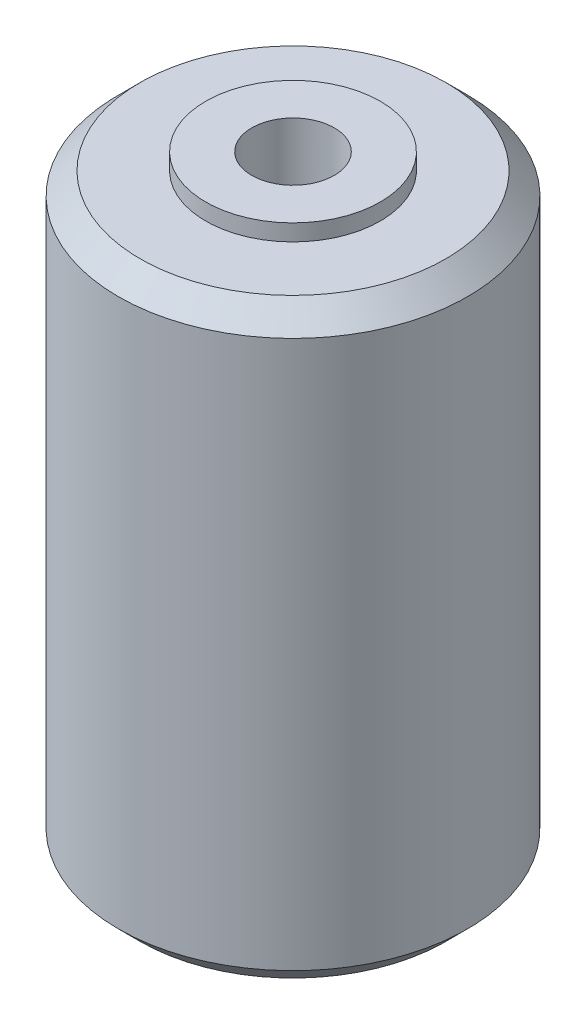
ISO-10303-21;
HEADER;
FILE_DESCRIPTION(('STEP AP214'),'2;1');
FILE_NAME('part.step','',(''),(''),'','','');
FILE_SCHEMA(('AUTOMOTIVE_DESIGN { 1 0 10303 214 1 1 1 1 }'));
ENDSEC;
DATA;
#1=APPLICATION_CONTEXT('core data for automotive mechanical design processes');
#2=APPLICATION_PROTOCOL_DEFINITION('international standard','automotive_design',2000,#1);
#3=PRODUCT_CONTEXT('',#1,'mechanical');
#4=PRODUCT('Part','Part','',(#3));
#5=PRODUCT_RELATED_PRODUCT_CATEGORY('part','',(#4));
#6=PRODUCT_DEFINITION_FORMATION('','',#4);
#7=PRODUCT_DEFINITION_CONTEXT('part definition',#1,'design');
#8=PRODUCT_DEFINITION('design','',#6,#7);
#9=PRODUCT_DEFINITION_SHAPE('','',#8);
#10=(LENGTH_UNIT() NAMED_UNIT(*) SI_UNIT(.MILLI.,.METRE.));
#11=(NAMED_UNIT(*) PLANE_ANGLE_UNIT() SI_UNIT($,.RADIAN.));
#12=(NAMED_UNIT(*) SI_UNIT($,.STERADIAN.) SOLID_ANGLE_UNIT());
#13=UNCERTAINTY_MEASURE_WITH_UNIT(LENGTH_MEASURE(1.E-05),#10,'distance_accuracy_value','');
#14=(GEOMETRIC_REPRESENTATION_CONTEXT(3) GLOBAL_UNCERTAINTY_ASSIGNED_CONTEXT((#13)) GLOBAL_UNIT_ASSIGNED_CONTEXT((#10,
#11,#12)) REPRESENTATION_CONTEXT('',''));
#15=CARTESIAN_POINT('',(0.,0.,0.));
#16=DIRECTION('',(0.,0.,1.));
#17=DIRECTION('',(1.,0.,0.));
#18=AXIS2_PLACEMENT_3D('',#15,#16,#17);
#19=CARTESIAN_POINT('',(0.,41.8605122421,0.));
#20=DIRECTION('',(0.,-1.,0.));
#21=DIRECTION('',(0.,0.,-1.));
#22=AXIS2_PLACEMENT_3D('',#19,#20,#21);
#23=CYLINDRICAL_SURFACE('',#22,6.35);
#24=CARTESIAN_POINT('',(0.,22.6999999997,0.));
#25=DIRECTION('',(0.,-1.,0.));
#26=DIRECTION('',(0.,0.,-1.));
#27=AXIS2_PLACEMENT_3D('',#24,#25,#26);
#28=CIRCLE('',#27,6.35);
#29=CARTESIAN_POINT('',(0.,22.6999999997,-6.35));
#30=VERTEX_POINT('',#29);
#31=EDGE_CURVE('E25',#30,#30,#28,.F.);
#32=ORIENTED_EDGE('',*,*,#31,.F.);
#33=EDGE_LOOP('',(#32));
#34=FACE_BOUND('',#33,.T.);
#35=CARTESIAN_POINT('',(0.,21.5000000004,0.));
#36=DIRECTION('',(0.,-1.,0.));
#37=DIRECTION('',(0.,0.,-1.));
#38=AXIS2_PLACEMENT_3D('',#35,#36,#37);
#39=CIRCLE('',#38,6.35);
#40=CARTESIAN_POINT('',(0.,21.5000000004,-6.35));
#41=VERTEX_POINT('',#40);
#42=EDGE_CURVE('E130',#41,#41,#39,.T.);
#43=ORIENTED_EDGE('',*,*,#42,.F.);
#44=EDGE_LOOP('',(#43));
#45=FACE_BOUND('',#44,.T.);
#46=ADVANCED_FACE('F22',(#34,#45),#23,.T.);
#47=CARTESIAN_POINT('',(0.,22.7,0.));
#48=DIRECTION('',(0.,1.,0.));
#49=DIRECTION('',(0.,0.,1.));
#50=AXIS2_PLACEMENT_3D('',#47,#48,#49);
#51=PLANE('',#50);
#52=CARTESIAN_POINT('',(0.,22.7000000004,0.));
#53=DIRECTION('',(0.,1.,0.));
#54=DIRECTION('',(0.,0.,1.));
#55=AXIS2_PLACEMENT_3D('',#52,#53,#54);
#56=CIRCLE('',#55,3.);
#57=CARTESIAN_POINT('',(0.,22.7000000004,3.));
#58=VERTEX_POINT('',#57);
#59=EDGE_CURVE('E122',#58,#58,#56,.F.);
#60=ORIENTED_EDGE('',*,*,#59,.T.);
#61=EDGE_LOOP('',(#60));
#62=FACE_BOUND('',#61,.T.);
#63=ORIENTED_EDGE('',*,*,#31,.T.);
#64=EDGE_LOOP('',(#63));
#65=FACE_BOUND('',#64,.T.);
#66=ADVANCED_FACE('F111',(#62,#65),#51,.T.);
#67=CARTESIAN_POINT('',(0.,-22.7,0.));
#68=DIRECTION('',(0.,1.,0.));
#69=DIRECTION('',(0.,0.,1.));
#70=AXIS2_PLACEMENT_3D('',#67,#68,#69);
#71=PLANE('',#70);
#72=CARTESIAN_POINT('',(0.,-22.7,0.));
#73=DIRECTION('',(0.,1.,0.));
#74=DIRECTION('',(0.,0.,1.));
#75=AXIS2_PLACEMENT_3D('',#72,#73,#74);
#76=CIRCLE('',#75,3.);
#77=CARTESIAN_POINT('',(0.,-22.7,3.));
#78=VERTEX_POINT('',#77);
#79=EDGE_CURVE('E140',#78,#78,#76,.T.);
#80=ORIENTED_EDGE('',*,*,#79,.T.);
#81=EDGE_LOOP('',(#80));
#82=FACE_BOUND('',#81,.T.);
#83=CARTESIAN_POINT('',(0.,-22.7000000007,0.));
#84=DIRECTION('',(0.,-1.,0.));
#85=DIRECTION('',(0.,0.,-1.));
#86=AXIS2_PLACEMENT_3D('',#83,#84,#85);
#87=CIRCLE('',#86,6.35);
#88=CARTESIAN_POINT('',(0.,-22.7000000007,-6.35));
#89=VERTEX_POINT('',#88);
#90=EDGE_CURVE('E126',#89,#89,#87,.F.);
#91=ORIENTED_EDGE('',*,*,#90,.F.);
#92=EDGE_LOOP('',(#91));
#93=FACE_BOUND('',#92,.T.);
#94=ADVANCED_FACE('F108',(#82,#93),#71,.F.);
#95=CARTESIAN_POINT('',(0.,41.8605122421,0.));
#96=DIRECTION('',(0.,-1.,0.));
#97=DIRECTION('',(0.,0.,-1.));
#98=AXIS2_PLACEMENT_3D('',#95,#96,#97);
#99=CYLINDRICAL_SURFACE('',#98,6.35);
#100=ORIENTED_EDGE('',*,*,#90,.T.);
#101=EDGE_LOOP('',(#100));
#102=FACE_BOUND('',#101,.T.);
#103=CARTESIAN_POINT('',(0.,-21.4999999996,0.));
#104=DIRECTION('',(0.,-1.,0.));
#105=DIRECTION('',(0.,0.,-1.));
#106=AXIS2_PLACEMENT_3D('',#103,#104,#105);
#107=CIRCLE('',#106,6.35);
#108=CARTESIAN_POINT('',(0.,-21.4999999996,-6.35));
#109=VERTEX_POINT('',#108);
#110=EDGE_CURVE('E143',#109,#109,#107,.T.);
#111=ORIENTED_EDGE('',*,*,#110,.T.);
#112=EDGE_LOOP('',(#111));
#113=FACE_BOUND('',#112,.T.);
#114=ADVANCED_FACE('F104',(#102,#113),#99,.T.);
#115=CARTESIAN_POINT('',(0.,21.5,0.));
#116=DIRECTION('',(0.,1.,0.));
#117=DIRECTION('',(0.,0.,1.));
#118=AXIS2_PLACEMENT_3D('',#115,#116,#117);
#119=PLANE('',#118);
#120=ORIENTED_EDGE('',*,*,#42,.T.);
#121=EDGE_LOOP('',(#120));
#122=FACE_BOUND('',#121,.T.);
#123=CARTESIAN_POINT('',(0.,21.5,0.));
#124=DIRECTION('',(0.,-1.,0.));
#125=DIRECTION('',(0.,0.,-1.));
#126=AXIS2_PLACEMENT_3D('',#123,#124,#125);
#127=CIRCLE('',#126,11.1125);
#128=CARTESIAN_POINT('',(0.,21.5,-11.1125));
#129=VERTEX_POINT('',#128);
#130=EDGE_CURVE('E145',#129,#129,#127,.T.);
#131=ORIENTED_EDGE('',*,*,#130,.F.);
#132=EDGE_LOOP('',(#131));
#133=FACE_BOUND('',#132,.T.);
#134=ADVANCED_FACE('F98',(#122,#133),#119,.T.);
#135=CARTESIAN_POINT('',(0.,-22.7,0.));
#136=DIRECTION('',(0.,1.,0.));
#137=DIRECTION('',(0.,0.,1.));
#138=AXIS2_PLACEMENT_3D('',#135,#136,#137);
#139=CYLINDRICAL_SURFACE('',#138,3.);
#140=ORIENTED_EDGE('',*,*,#59,.F.);
#141=EDGE_LOOP('',(#140));
#142=FACE_BOUND('',#141,.T.);
#143=CARTESIAN_POINT('',(1.64999999997881,15.,-2.5054939632621));
#144=CARTESIAN_POINT('',(1.64999840374239,14.9153708936247,-2.50549638400823));
#145=CARTESIAN_POINT('',(1.64345056128063,14.8307298608441,-2.50984429312524));
#146=CARTESIAN_POINT('',(1.61766820329153,14.6641915008115,-2.52653380821172));
#147=CARTESIAN_POINT('',(1.59842157284982,14.5822968721651,-2.53888304741797));
#148=CARTESIAN_POINT('',(1.54839307975191,14.4239437560946,-2.56969382834086));
#149=CARTESIAN_POINT('',(1.51767952421347,14.3474562061832,-2.58811910143637));
#150=CARTESIAN_POINT('',(1.445808157873,14.2007377586914,-2.62894336394163));
#151=CARTESIAN_POINT('',(1.40464700957015,14.1305088701552,-2.65134362247777));
#152=CARTESIAN_POINT('',(1.30819183349229,13.99050944756,-2.7003413001341));
#153=CARTESIAN_POINT('',(1.25189044896297,13.9215011613215,-2.72713413750509));
#154=CARTESIAN_POINT('',(1.12882699873976,13.7932889054095,-2.78033210845858));
#155=CARTESIAN_POINT('',(1.06205795707768,13.7340915285402,-2.80673697055464));
#156=CARTESIAN_POINT('',(0.912963549431928,13.6221708897389,-2.85889021724714));
#157=CARTESIAN_POINT('',(0.829793649592543,13.5704443324042,-2.88438619675496));
#158=CARTESIAN_POINT('',(0.654291228543131,13.4821004677816,-2.92917486122211));
#159=CARTESIAN_POINT('',(0.561971033053669,13.4454631689517,-2.94847574643854));
#160=CARTESIAN_POINT('',(0.391418922382221,13.395186431123,-2.97532920501414));
#161=CARTESIAN_POINT('',(0.314389644419919,13.3783062858042,-2.98451058646595));
#162=CARTESIAN_POINT('',(0.158243160172314,13.3557148045967,-2.99684529996306));
#163=CARTESIAN_POINT('',(0.0791268427110069,13.3499987895632,-3.00000115743207));
#164=CARTESIAN_POINT('',(-0.0857394555554382,13.3500013115927,-2.99999874584159));
#165=CARTESIAN_POINT('',(-0.171491269053558,13.3567153517836,-2.99629076639798));
#166=CARTESIAN_POINT('',(-0.340348376484559,13.3832202031107,-2.98183771920608));
#167=CARTESIAN_POINT('',(-0.423452291679825,13.4030177137218,-2.9710890462504));
#168=CARTESIAN_POINT('',(-0.584397615441963,13.4546521590814,-2.94365850592254));
#169=CARTESIAN_POINT('',(-0.662257568957315,13.4864437222334,-2.92699901221874));
#170=CARTESIAN_POINT('',(-0.811396545708622,13.5608721508766,-2.88921483820871));
#171=CARTESIAN_POINT('',(-0.882674264516605,13.60351115979,-2.8680892755604));
#172=CARTESIAN_POINT('',(-1.02211397679698,13.7017135075675,-2.8215333458695));
#173=CARTESIAN_POINT('',(-1.08972586800158,13.7579633096431,-2.79590698364791));
#174=CARTESIAN_POINT('',(-1.21508250549719,13.8802876821038,-2.74375531569346));
#175=CARTESIAN_POINT('',(-1.27281736357076,13.9463719758152,-2.71722914058829));
#176=CARTESIAN_POINT('',(-1.38253830070294,14.0942501396172,-2.66320939989594));
#177=CARTESIAN_POINT('',(-1.4333919087059,14.1769511793747,-2.6358794181072));
#178=CARTESIAN_POINT('',(-1.52024089502086,14.351297024783,-2.58676868519409));
#179=CARTESIAN_POINT('',(-1.55625793396417,14.4429285487804,-2.56497986218539));
#180=CARTESIAN_POINT('',(-1.60561843894336,14.6120858340947,-2.53429331170645));
#181=CARTESIAN_POINT('',(-1.62218822121407,14.6883498268501,-2.52362317860781));
#182=CARTESIAN_POINT('',(-1.64437513124578,14.8430737320748,-2.50922530446738));
#183=CARTESIAN_POINT('',(-1.65000148001366,14.921531739252,-2.50549171876547));
#184=CARTESIAN_POINT('',(-1.64999840378477,15.0846291059664,-2.50549638400653));
#185=CARTESIAN_POINT('',(-1.64345056132893,15.1692701387406,-2.50984429310046));
#186=CARTESIAN_POINT('',(-1.61766820337297,15.3358084987663,-2.5265338081525));
#187=CARTESIAN_POINT('',(-1.59842157295841,15.4177031274122,-2.53888304734747));
#188=CARTESIAN_POINT('',(-1.54839307990936,15.5760562434857,-2.56969382824747));
#189=CARTESIAN_POINT('',(-1.51767952439265,15.6525437934004,-2.58811910133138));
#190=CARTESIAN_POINT('',(-1.44580815809721,15.7992622409016,-2.62894336381747));
#191=CARTESIAN_POINT('',(-1.40464700981771,15.869491129444,-2.65134362234603));
#192=CARTESIAN_POINT('',(-1.30819183379094,16.0094905520521,-2.70034129998896));
#193=CARTESIAN_POINT('',(-1.25189044928986,16.078498838298,-2.72713413735439));
#194=CARTESIAN_POINT('',(-1.12882699912413,16.20671109423,-2.78033210830183));
#195=CARTESIAN_POINT('',(-1.06205795749126,16.2659084711119,-2.80673697039741));
#196=CARTESIAN_POINT('',(-0.9129635498953,16.377829109954,-2.85889021709868));
#197=CARTESIAN_POINT('',(-0.829793650074897,16.4295556673156,-2.88438619661576));
#198=CARTESIAN_POINT('',(-0.654291229058896,16.517899531996,-2.92917486110651));
#199=CARTESIAN_POINT('',(-0.561971033583834,16.5545368308566,-2.94847574633724));
#200=CARTESIAN_POINT('',(-0.391418922842449,16.6048135687693,-2.97532920495572));
#201=CARTESIAN_POINT('',(-0.314389644792517,16.6216937141282,-2.98451058642913));
#202=CARTESIAN_POINT('',(-0.15824316036224,16.6442851953895,-2.99684529995543));
#203=CARTESIAN_POINT('',(-0.0791268428058968,16.6500012104367,-3.00000115743205));
#204=CARTESIAN_POINT('',(0.0857394555556574,16.6499986884073,-2.99999874584161));
#205=CARTESIAN_POINT('',(0.171491269053796,16.6432846482164,-2.99629076639798));
#206=CARTESIAN_POINT('',(0.340348376484729,16.6167797968893,-2.98183771920605));
#207=CARTESIAN_POINT('',(0.423452291679915,16.5969822862782,-2.97108904625038));
#208=CARTESIAN_POINT('',(0.584397615442001,16.5453478409186,-2.94365850592253));
#209=CARTESIAN_POINT('',(0.662257568957375,16.5135562777665,-2.92699901221873));
#210=CARTESIAN_POINT('',(0.811396545708668,16.4391278491234,-2.88921483820869));
#211=CARTESIAN_POINT('',(0.88267426451662,16.39648884021,-2.86808927556038));
#212=CARTESIAN_POINT('',(1.0221139767969,16.2982864924326,-2.82153334586954));
#213=CARTESIAN_POINT('',(1.08972586800144,16.242036690357,-2.795906983648));
#214=CARTESIAN_POINT('',(1.21508250549701,16.1197123178963,-2.74375531569351));
#215=CARTESIAN_POINT('',(1.27281736357056,16.0536280241849,-2.71722914058825));
#216=CARTESIAN_POINT('',(1.38253830070317,15.9057498603827,-2.66320939989597));
#217=CARTESIAN_POINT('',(1.43339190870662,15.823048820625,-2.63587941810743));
#218=CARTESIAN_POINT('',(1.52024089502039,15.6487029752167,-2.58676868519372));
#219=CARTESIAN_POINT('',(1.55625793396207,15.5570714512195,-2.56497986218423));
#220=CARTESIAN_POINT('',(1.60561843896328,15.3879141658426,-2.53429331169599));
#221=CARTESIAN_POINT('',(1.62218822124758,15.3116501730212,-2.52362317859283));
#222=CARTESIAN_POINT('',(1.64437513126856,15.1569262676613,-2.50922530444582));
#223=CARTESIAN_POINT('',(1.6500014800121,15.078468260415,-2.50549171874191));
#224=CARTESIAN_POINT('',(1.64999999997881,15.,-2.5054939632621));
#225=B_SPLINE_CURVE_WITH_KNOTS('',3,(#143,#144,#145,#146,#147,#148,#149,#150,#151,#152,#153,
#154,#155,#156,#157,#158,#159,#160,#161,#162,#163,#164,#165,#166,#167,#168,#169,#170,#171,#172,
#173,#174,#175,#176,#177,#178,#179,#180,#181,#182,#183,#184,#185,#186,#187,#188,#189,#190,#191,
#192,#193,#194,#195,#196,#197,#198,#199,#200,#201,#202,#203,#204,#205,#206,#207,#208,#209,#210,
#211,#212,#213,#214,#215,#216,#217,#218,#219,#220,#221,#222,#223,#224),.UNSPECIFIED.,.T.,.F.,(4,
2,2,2,2,2,2,2,2,2,2,2,2,2,2,2,2,2,2,2,2,2,2,2,2,2,2,2,2,2,2,2,2,2,2,2,2,2,2,2,4),(0.,
0.253564174119438,0.507370604325378,0.759688655533113,1.01208741182867,1.2899706705788,
1.5680399127192,1.87005826832862,2.17167518687084,2.40886924606111,2.64596387039523,
2.90287244034506,3.15991266401299,3.41599013933307,3.67211825414013,3.94583529023402,
4.21982476976412,4.52089904055169,4.82153218701447,5.05683570170709,5.29194086211861,
5.54550503621304,5.7993114663959,6.05162951758052,6.30402827385173,6.58191153256248,
6.85998077466422,7.16199913027546,7.46361604882062,7.7008101082955,7.93790473291365,
8.19481330286378,8.4518535265314,8.70793100185158,8.96405911665854,9.23777615275208,
9.51176563228254,9.81283990307056,10.1134730495329,10.3487765644238,10.5838817250346),.UNSPECIFIED.);
#226=CARTESIAN_POINT('',(1.64999999997881,15.,-2.5054939632621));
#227=VERTEX_POINT('',#226);
#228=EDGE_CURVE('E83',#227,#227,#225,.T.);
#229=ORIENTED_EDGE('',*,*,#228,.T.);
#230=EDGE_LOOP('',(#229));
#231=FACE_BOUND('',#230,.T.);
#232=CARTESIAN_POINT('',(1.64999999997882,-15.,-2.50549396326209));
#233=CARTESIAN_POINT('',(1.6499984037424,-15.0846291063753,-2.50549638400822));
#234=CARTESIAN_POINT('',(1.64345056128064,-15.1692701391559,-2.50984429312524));
#235=CARTESIAN_POINT('',(1.61766820329154,-15.3358084991885,-2.52653380821171));
#236=CARTESIAN_POINT('',(1.59842157284983,-15.4177031278349,-2.53888304741796));
#237=CARTESIAN_POINT('',(1.54839307975192,-15.5760562439054,-2.56969382834085));
#238=CARTESIAN_POINT('',(1.51767952421348,-15.6525437938168,-2.58811910143636));
#239=CARTESIAN_POINT('',(1.44580815787301,-15.7992622413086,-2.62894336394162));
#240=CARTESIAN_POINT('',(1.40464700957016,-15.8694911298448,-2.65134362247776));
#241=CARTESIAN_POINT('',(1.3081918334923,-16.00949055244,-2.7003413001341));
#242=CARTESIAN_POINT('',(1.25189044896299,-16.0784988386785,-2.72713413750509));
#243=CARTESIAN_POINT('',(1.12882699873977,-16.2067110945905,-2.78033210845857));
#244=CARTESIAN_POINT('',(1.0620579570777,-16.2659084714598,-2.80673697055464));
#245=CARTESIAN_POINT('',(0.912963549431941,-16.3778291102611,-2.85889021724714));
#246=CARTESIAN_POINT('',(0.829793649592557,-16.4295556675958,-2.88438619675496));
#247=CARTESIAN_POINT('',(0.654291228543146,-16.5178995322184,-2.92917486122211));
#248=CARTESIAN_POINT('',(0.561971033053684,-16.5545368310483,-2.94847574643854));
#249=CARTESIAN_POINT('',(0.391418922382234,-16.604813568877,-2.97532920501414));
#250=CARTESIAN_POINT('',(0.314389644419929,-16.6216937141958,-2.98451058646595));
#251=CARTESIAN_POINT('',(0.158243160172319,-16.6442851954033,-2.99684529996305));
#252=CARTESIAN_POINT('',(0.079126842711009,-16.6500012104368,-3.00000115743207));
#253=CARTESIAN_POINT('',(-0.0857394555554387,-16.6499986884073,-2.99999874584159));
#254=CARTESIAN_POINT('',(-0.171491269053559,-16.6432846482164,-2.99629076639798));
#255=CARTESIAN_POINT('',(-0.340348376484559,-16.6167797968893,-2.98183771920608));
#256=CARTESIAN_POINT('',(-0.423452291679826,-16.5969822862782,-2.9710890462504));
#257=CARTESIAN_POINT('',(-0.584397615441963,-16.5453478409186,-2.94365850592254));
#258=CARTESIAN_POINT('',(-0.662257568957316,-16.5135562777666,-2.92699901221874));
#259=CARTESIAN_POINT('',(-0.811396545708622,-16.4391278491234,-2.88921483820871));
#260=CARTESIAN_POINT('',(-0.882674264516604,-16.39648884021,-2.8680892755604));
#261=CARTESIAN_POINT('',(-1.02211397679698,-16.2982864924325,-2.8215333458695));
#262=CARTESIAN_POINT('',(-1.08972586800158,-16.2420366903569,-2.79590698364792));
#263=CARTESIAN_POINT('',(-1.21508250549719,-16.1197123178962,-2.74375531569346));
#264=CARTESIAN_POINT('',(-1.27281736357076,-16.0536280241848,-2.71722914058829));
#265=CARTESIAN_POINT('',(-1.38253830070294,-15.9057498603828,-2.66320939989594));
#266=CARTESIAN_POINT('',(-1.43339190870589,-15.8230488206253,-2.63587941810721));
#267=CARTESIAN_POINT('',(-1.52024089502085,-15.648702975217,-2.58676868519409));
#268=CARTESIAN_POINT('',(-1.55625793396416,-15.5570714512196,-2.56497986218539));
#269=CARTESIAN_POINT('',(-1.60561843894335,-15.3879141659053,-2.53429331170645));
#270=CARTESIAN_POINT('',(-1.62218822121406,-15.3116501731499,-2.52362317860782));
#271=CARTESIAN_POINT('',(-1.64437513124577,-15.1569262679252,-2.50922530446738));
#272=CARTESIAN_POINT('',(-1.65000148001365,-15.078468260748,-2.50549171876548));
#273=CARTESIAN_POINT('',(-1.64999840378476,-14.9153708940336,-2.50549638400653));
#274=CARTESIAN_POINT('',(-1.64345056132892,-14.8307298612594,-2.50984429310046));
#275=CARTESIAN_POINT('',(-1.61766820337296,-14.6641915012337,-2.5265338081525));
#276=CARTESIAN_POINT('',(-1.5984215729584,-14.5822968725878,-2.53888304734747));
#277=CARTESIAN_POINT('',(-1.54839307990935,-14.4239437565143,-2.56969382824748));
#278=CARTESIAN_POINT('',(-1.51767952439264,-14.3474562065996,-2.58811910133138));
#279=CARTESIAN_POINT('',(-1.4458081580972,-14.2007377590984,-2.62894336381748));
#280=CARTESIAN_POINT('',(-1.40464700981771,-14.130508870556,-2.65134362234604));
#281=CARTESIAN_POINT('',(-1.30819183379094,-13.9905094479479,-2.70034129998896));
#282=CARTESIAN_POINT('',(-1.25189044928986,-13.921501161702,-2.72713413735439));
#283=CARTESIAN_POINT('',(-1.12882699912413,-13.79328890577,-2.78033210830183));
#284=CARTESIAN_POINT('',(-1.06205795749126,-13.7340915288881,-2.80673697039741));
#285=CARTESIAN_POINT('',(-0.912963549895295,-13.622170890046,-2.85889021709868));
#286=CARTESIAN_POINT('',(-0.829793650074891,-13.5704443326844,-2.88438619661576));
#287=CARTESIAN_POINT('',(-0.654291229058888,-13.482100468004,-2.92917486110652));
#288=CARTESIAN_POINT('',(-0.561971033583826,-13.4454631691434,-2.94847574633725));
#289=CARTESIAN_POINT('',(-0.391418922842443,-13.3951864312307,-2.97532920495573));
#290=CARTESIAN_POINT('',(-0.314389644792512,-13.3783062858718,-2.98451058642914));
#291=CARTESIAN_POINT('',(-0.158243160362237,-13.3557148046105,-2.99684529995543));
#292=CARTESIAN_POINT('',(-0.0791268428058954,-13.3499987895633,-3.00000115743205));
#293=CARTESIAN_POINT('',(0.0857394555556574,-13.3500013115927,-2.99999874584161));
#294=CARTESIAN_POINT('',(0.171491269053796,-13.3567153517836,-2.99629076639798));
#295=CARTESIAN_POINT('',(0.340348376484729,-13.3832202031107,-2.98183771920605));
#296=CARTESIAN_POINT('',(0.423452291679915,-13.4030177137218,-2.97108904625038));
#297=CARTESIAN_POINT('',(0.584397615442001,-13.4546521590814,-2.94365850592253));
#298=CARTESIAN_POINT('',(0.662257568957375,-13.4864437222335,-2.92699901221873));
#299=CARTESIAN_POINT('',(0.811396545708669,-13.5608721508766,-2.88921483820869));
#300=CARTESIAN_POINT('',(0.882674264516621,-13.60351115979,-2.86808927556038));
#301=CARTESIAN_POINT('',(1.0221139767969,-13.7017135075674,-2.82153334586954));
#302=CARTESIAN_POINT('',(1.08972586800144,-13.757963309643,-2.795906983648));
#303=CARTESIAN_POINT('',(1.21508250549701,-13.8802876821037,-2.74375531569351));
#304=CARTESIAN_POINT('',(1.27281736357056,-13.9463719758151,-2.71722914058825));
#305=CARTESIAN_POINT('',(1.38253830070317,-14.0942501396173,-2.66320939989597));
#306=CARTESIAN_POINT('',(1.43339190870662,-14.1769511793749,-2.63587941810743));
#307=CARTESIAN_POINT('',(1.5202408950204,-14.3512970247833,-2.58676868519372));
#308=CARTESIAN_POINT('',(1.55625793396208,-14.4429285487805,-2.56497986218422));
#309=CARTESIAN_POINT('',(1.60561843896329,-14.6120858341574,-2.53429331169599));
#310=CARTESIAN_POINT('',(1.62218822124759,-14.6883498269788,-2.52362317859283));
#311=CARTESIAN_POINT('',(1.64437513126857,-14.8430737323387,-2.50922530444582));
#312=CARTESIAN_POINT('',(1.65000148001211,-14.921531739585,-2.5054917187419));
#313=CARTESIAN_POINT('',(1.64999999997882,-15.,-2.50549396326209));
#314=B_SPLINE_CURVE_WITH_KNOTS('',3,(#232,#233,#234,#235,#236,#237,#238,#239,#240,#241,#242,
#243,#244,#245,#246,#247,#248,#249,#250,#251,#252,#253,#254,#255,#256,#257,#258,#259,#260,#261,
#262,#263,#264,#265,#266,#267,#268,#269,#270,#271,#272,#273,#274,#275,#276,#277,#278,#279,#280,
#281,#282,#283,#284,#285,#286,#287,#288,#289,#290,#291,#292,#293,#294,#295,#296,#297,#298,#299,
#300,#301,#302,#303,#304,#305,#306,#307,#308,#309,#310,#311,#312,#313),.UNSPECIFIED.,.T.,.F.,(4,
2,2,2,2,2,2,2,2,2,2,2,2,2,2,2,2,2,2,2,2,2,2,2,2,2,2,2,2,2,2,2,2,2,2,2,2,2,2,2,4),(0.,
0.253564174119438,0.507370604325378,0.759688655533112,1.01208741182867,1.28997067057879,
1.5680399127192,1.87005826832862,2.17167518687083,2.40886924606111,2.64596387039525,
2.90287244034507,3.159912664013,3.41599013933309,3.67211825414014,3.94583529023403,
4.21982476976414,4.52089904055171,4.82153218701449,5.0568357017071,5.29194086211861,
5.54550503621304,5.7993114663959,6.05162951758052,6.30402827385172,6.58191153256248,
6.85998077466422,7.16199913027546,7.46361604882062,7.7008101082955,7.93790473291364,
8.19481330286377,8.45185352653139,8.70793100185156,8.96405911665853,9.23777615275207,
9.51176563228253,9.81283990307055,10.1134730495329,10.3487765644238,10.5838817250346),.UNSPECIFIED.);
#315=CARTESIAN_POINT('',(1.64999999997882,-15.,-2.50549396326209));
#316=VERTEX_POINT('',#315);
#317=EDGE_CURVE('E78',#316,#316,#314,.T.);
#318=ORIENTED_EDGE('',*,*,#317,.T.);
#319=EDGE_LOOP('',(#318));
#320=FACE_BOUND('',#319,.T.);
#321=ORIENTED_EDGE('',*,*,#79,.F.);
#322=EDGE_LOOP('',(#321));
#323=FACE_BOUND('',#322,.T.);
#324=ADVANCED_FACE('F92',(#142,#231,#320,#323),#139,.F.);
#325=CARTESIAN_POINT('',(0.,-21.5,0.));
#326=DIRECTION('',(0.,1.,0.));
#327=DIRECTION('',(0.,0.,1.));
#328=AXIS2_PLACEMENT_3D('',#325,#326,#327);
#329=PLANE('',#328);
#330=ORIENTED_EDGE('',*,*,#110,.F.);
#331=EDGE_LOOP('',(#330));
#332=FACE_BOUND('',#331,.T.);
#333=CARTESIAN_POINT('',(0.,-21.5000000000007,0.));
#334=DIRECTION('',(0.,1.,0.));
#335=DIRECTION('',(0.,0.,1.));
#336=AXIS2_PLACEMENT_3D('',#333,#334,#335);
#337=CIRCLE('',#336,11.1125000000007);
#338=CARTESIAN_POINT('',(0.,-21.5000000000007,11.1125000000007));
#339=VERTEX_POINT('',#338);
#340=EDGE_CURVE('E46',#339,#339,#337,.T.);
#341=ORIENTED_EDGE('',*,*,#340,.F.);
#342=EDGE_LOOP('',(#341));
#343=FACE_BOUND('',#342,.T.);
#344=ADVANCED_FACE('F97',(#332,#343),#329,.F.);
#345=CARTESIAN_POINT('',(0.,19.9124999999993,0.));
#346=DIRECTION('',(0.,-1.,0.));
#347=DIRECTION('',(0.,0.,-1.));
#348=AXIS2_PLACEMENT_3D('',#345,#346,#347);
#349=CONICAL_SURFACE('',#348,12.6999999999993,0.785398163397);
#350=ORIENTED_EDGE('',*,*,#130,.T.);
#351=EDGE_LOOP('',(#350));
#352=FACE_BOUND('',#351,.T.);
#353=CARTESIAN_POINT('',(0.,19.9125,0.));
#354=DIRECTION('',(0.,-1.,0.));
#355=DIRECTION('',(0.,0.,-1.));
#356=AXIS2_PLACEMENT_3D('',#353,#354,#355);
#357=CIRCLE('',#356,12.7);
#358=CARTESIAN_POINT('',(0.,19.9125,-12.7));
#359=VERTEX_POINT('',#358);
#360=EDGE_CURVE('E43',#359,#359,#357,.T.);
#361=ORIENTED_EDGE('',*,*,#360,.F.);
#362=EDGE_LOOP('',(#361));
#363=FACE_BOUND('',#362,.T.);
#364=ADVANCED_FACE('F159',(#352,#363),#349,.T.);
#365=CARTESIAN_POINT('',(0.,15.,0.));
#366=DIRECTION('',(0.,0.,1.));
#367=DIRECTION('',(1.,0.,0.));
#368=AXIS2_PLACEMENT_3D('',#365,#366,#367);
#369=CYLINDRICAL_SURFACE('',#368,1.65);
#370=ORIENTED_EDGE('',*,*,#228,.F.);
#371=EDGE_LOOP('',(#370));
#372=FACE_BOUND('',#371,.T.);
#373=CARTESIAN_POINT('',(0.,16.65,-12.7));
#374=CARTESIAN_POINT('',(-0.0922613706015616,16.6499960266368,-12.6999986483359));
#375=CARTESIAN_POINT('',(-0.184581712969282,16.6422353589815,-12.698983991526));
#376=CARTESIAN_POINT('',(-0.36665381896258,16.6113994418027,-12.6950337968835));
#377=CARTESIAN_POINT('',(-0.45640272894946,16.5883078169848,-12.6920962051737));
#378=CARTESIAN_POINT('',(-0.630667643384161,16.5275031550844,-12.6846308888954));
#379=CARTESIAN_POINT('',(-0.715187195161179,16.4898001585595,-12.6801042564754));
#380=CARTESIAN_POINT('',(-0.876680404764729,16.4008671595393,-12.6699639395096));
#381=CARTESIAN_POINT('',(-0.953655618333544,16.3496399539966,-12.6643504797955));
#382=CARTESIAN_POINT('',(-1.09834448754996,16.2347934063494,-12.6526259549517));
#383=CARTESIAN_POINT('',(-1.16600785478158,16.1711109550385,-12.6465124520145));
#384=CARTESIAN_POINT('',(-1.28973411953138,16.0332781566404,-12.6344948729124));
#385=CARTESIAN_POINT('',(-1.34579386345574,15.9591249730398,-12.6285908540406));
#386=CARTESIAN_POINT('',(-1.44491493186581,15.8021088518647,-12.61763548826));
#387=CARTESIAN_POINT('',(-1.48792229372565,15.7192116153581,-12.6125877182579));
#388=CARTESIAN_POINT('',(-1.55934132232046,15.5473524320158,-12.6039581295904));
#389=CARTESIAN_POINT('',(-1.58776927485075,15.4583973784371,-12.6003746761374));
#390=CARTESIAN_POINT('',(-1.62228028697603,15.307466304609,-12.5959671608161));
#391=CARTESIAN_POINT('',(-1.6326603754509,15.2464533709182,-12.5946206585225));
#392=CARTESIAN_POINT('',(-1.64652153728125,15.1236357848426,-12.5928160112748));
#393=CARTESIAN_POINT('',(-1.65000266511255,15.0618311387133,-12.5923578593062));
#394=CARTESIAN_POINT('',(-1.64999602341034,14.9077423322541,-12.5923601889618));
#395=CARTESIAN_POINT('',(-1.64223595773393,14.8154256831494,-12.5933836646408));
#396=CARTESIAN_POINT('',(-1.61140264942754,14.6333612522402,-12.597365349171));
#397=CARTESIAN_POINT('',(-1.58831301888257,14.543616326933,-12.6003256284931));
#398=CARTESIAN_POINT('',(-1.52751418964121,14.3693598394773,-12.6078401281504));
#399=CARTESIAN_POINT('',(-1.48981512575569,14.2848446963717,-12.612393243296));
#400=CARTESIAN_POINT('',(-1.4008913903022,14.1233588852263,-12.6225788360358));
#401=CARTESIAN_POINT('',(-1.34966950620144,14.0463866668373,-12.6282110911207));
#402=CARTESIAN_POINT('',(-1.23482835305465,13.9016944622995,-12.6399580315527));
#403=CARTESIAN_POINT('',(-1.17114478450977,13.8340257024641,-12.6460751167178));
#404=CARTESIAN_POINT('',(-1.03330748177513,13.7102890152266,-12.6580824507853));
#405=CARTESIAN_POINT('',(-0.959150925293786,13.6542242249704,-12.6639726379962));
#406=CARTESIAN_POINT('',(-0.802131812823004,13.5550978506845,-12.6748884883045));
#407=CARTESIAN_POINT('',(-0.719235538826974,13.512089310033,-12.6799105900136));
#408=CARTESIAN_POINT('',(-0.547378437680788,13.4406678269497,-12.6884888294279));
#409=CARTESIAN_POINT('',(-0.458424495836816,13.4122386168661,-12.6920466001579));
#410=CARTESIAN_POINT('',(-0.307490063388877,13.3777240200307,-12.6964208871056));
#411=CARTESIAN_POINT('',(-0.246472366923986,13.3673423086062,-12.6977566275013));
#412=CARTESIAN_POINT('',(-0.123645272995091,13.353478993515,-12.6995466335294));
#413=CARTESIAN_POINT('',(-0.0618358816038709,13.3499973369525,-12.7000009059191));
#414=CARTESIAN_POINT('',(0.0922613706015605,13.3500039733632,-12.6999986483359));
#415=CARTESIAN_POINT('',(0.184581712969281,13.3577646410185,-12.698983991526));
#416=CARTESIAN_POINT('',(0.366653818962579,13.3886005581973,-12.6950337968835));
#417=CARTESIAN_POINT('',(0.456402728949459,13.4116921830152,-12.6920962051737));
#418=CARTESIAN_POINT('',(0.63066764338416,13.4724968449156,-12.6846308888954));
#419=CARTESIAN_POINT('',(0.715187195161178,13.5101998414405,-12.6801042564754));
#420=CARTESIAN_POINT('',(0.876680404764728,13.5991328404607,-12.6699639395096));
#421=CARTESIAN_POINT('',(0.953655618333541,13.6503600460034,-12.6643504797955));
#422=CARTESIAN_POINT('',(1.09834448754995,13.7652065936506,-12.6526259549517));
#423=CARTESIAN_POINT('',(1.16600785478157,13.8288890449615,-12.6465124520145));
#424=CARTESIAN_POINT('',(1.28973411953137,13.9667218433596,-12.6344948729124));
#425=CARTESIAN_POINT('',(1.34579386345573,14.0408750269602,-12.6285908540406));
#426=CARTESIAN_POINT('',(1.44491493186581,14.1978911481353,-12.61763548826));
#427=CARTESIAN_POINT('',(1.48792229372564,14.280788384642,-12.6125877182579));
#428=CARTESIAN_POINT('',(1.55934132232045,14.4526475679842,-12.6039581295904));
#429=CARTESIAN_POINT('',(1.58776927485075,14.5416026215629,-12.6003746761374));
#430=CARTESIAN_POINT('',(1.62228028697602,14.692533695391,-12.5959671608161));
#431=CARTESIAN_POINT('',(1.63266037545089,14.7535466290818,-12.5946206585225));
#432=CARTESIAN_POINT('',(1.64652153728123,14.8763642151574,-12.5928160112748));
#433=CARTESIAN_POINT('',(1.65000266511254,14.9381688612867,-12.5923578593062));
#434=CARTESIAN_POINT('',(1.64999602341032,15.0922576677459,-12.5923601889618));
#435=CARTESIAN_POINT('',(1.64223595773392,15.1845743168506,-12.5933836646408));
#436=CARTESIAN_POINT('',(1.61140264942753,15.3666387477598,-12.597365349171));
#437=CARTESIAN_POINT('',(1.58831301888255,15.456383673067,-12.6003256284931));
#438=CARTESIAN_POINT('',(1.5275141896412,15.6306401605227,-12.6078401281504));
#439=CARTESIAN_POINT('',(1.48981512575567,15.7151553036283,-12.612393243296));
#440=CARTESIAN_POINT('',(1.40089139030219,15.8766411147737,-12.6225788360358));
#441=CARTESIAN_POINT('',(1.34966950620143,15.9536133331627,-12.6282110911207));
#442=CARTESIAN_POINT('',(1.23482835305464,16.0983055377005,-12.6399580315527));
#443=CARTESIAN_POINT('',(1.17114478450975,16.1659742975359,-12.6460751167178));
#444=CARTESIAN_POINT('',(1.03330748177512,16.2897109847734,-12.6580824507853));
#445=CARTESIAN_POINT('',(0.959150925293773,16.3457757750296,-12.6639726379962));
#446=CARTESIAN_POINT('',(0.802131812822991,16.4449021493155,-12.6748884883045));
#447=CARTESIAN_POINT('',(0.719235538826961,16.487910689967,-12.6799105900136));
#448=CARTESIAN_POINT('',(0.547378437680775,16.5593321730503,-12.6884888294279));
#449=CARTESIAN_POINT('',(0.458424495836804,16.5877613831339,-12.6920466001579));
#450=CARTESIAN_POINT('',(0.307490063388866,16.6222759799693,-12.6964208871056));
#451=CARTESIAN_POINT('',(0.246472366923977,16.6326576913938,-12.6977566275013));
#452=CARTESIAN_POINT('',(0.123645272995085,16.646521006485,-12.6995466335294));
#453=CARTESIAN_POINT('',(0.0618358816038677,16.6500026630475,-12.7000009059191));
#454=CARTESIAN_POINT('',(0.,16.65,-12.7));
#455=B_SPLINE_CURVE_WITH_KNOTS('',3,(#373,#374,#375,#376,#377,#378,#379,#380,#381,#382,#383,
#384,#385,#386,#387,#388,#389,#390,#391,#392,#393,#394,#395,#396,#397,#398,#399,#400,#401,#402,
#403,#404,#405,#406,#407,#408,#409,#410,#411,#412,#413,#414,#415,#416,#417,#418,#419,#420,#421,
#422,#423,#424,#425,#426,#427,#428,#429,#430,#431,#432,#433,#434,#435,#436,#437,#438,#439,#440,
#441,#442,#443,#444,#445,#446,#447,#448,#449,#450,#451,#452,#453,#454),.UNSPECIFIED.,.T.,.F.,(4,
2,2,2,2,2,2,2,2,2,2,2,2,2,2,2,2,2,2,2,2,2,2,2,2,2,2,2,2,2,2,2,2,2,2,2,2,2,2,2,4),(0.,
0.276557981767843,0.553411836773097,0.830075781331942,1.1066825535578,1.38472897037035,
1.66285085477184,1.9421073913385,2.22105130377737,2.4063946191166,2.59173647093545,
2.86828332645777,3.14512629864269,3.42177756298099,3.69837184548996,3.97643282857887,
4.25456888785073,4.53382025192016,4.81275934497319,4.99811685272514,5.1834729395218,
5.46003092128964,5.7368847762949,6.01354872085374,6.2901554930796,6.56820190989215,
6.84632379429364,7.1255803308603,7.40452424329917,7.5898675586384,7.77520941045723,
8.05175626597956,8.32859923816448,8.60525050250278,8.88184478501175,9.15990576810066,
9.43804182737252,9.71729319144195,9.99623228449498,10.1815897922469,10.3669458790436),.UNSPECIFIED.);
#456=CARTESIAN_POINT('',(0.,16.65,-12.7));
#457=VERTEX_POINT('',#456);
#458=EDGE_CURVE('E40',#457,#457,#455,.T.);
#459=ORIENTED_EDGE('',*,*,#458,.F.);
#460=EDGE_LOOP('',(#459));
#461=FACE_BOUND('',#460,.T.);
#462=ADVANCED_FACE('F71',(#372,#461),#369,.F.);
#463=CARTESIAN_POINT('',(0.,-15.,0.));
#464=DIRECTION('',(0.,0.,1.));
#465=DIRECTION('',(1.,0.,0.));
#466=AXIS2_PLACEMENT_3D('',#463,#464,#465);
#467=CYLINDRICAL_SURFACE('',#466,1.65);
#468=ORIENTED_EDGE('',*,*,#317,.F.);
#469=EDGE_LOOP('',(#468));
#470=FACE_BOUND('',#469,.T.);
#471=CARTESIAN_POINT('',(0.,-13.35,-12.7));
#472=CARTESIAN_POINT('',(-0.0922613706015615,-13.3500039733632,-12.6999986483359));
#473=CARTESIAN_POINT('',(-0.184581712969282,-13.3577646410185,-12.698983991526));
#474=CARTESIAN_POINT('',(-0.366653818962579,-13.3886005581973,-12.6950337968835));
#475=CARTESIAN_POINT('',(-0.45640272894946,-13.4116921830152,-12.6920962051737));
#476=CARTESIAN_POINT('',(-0.630667643384161,-13.4724968449156,-12.6846308888954));
#477=CARTESIAN_POINT('',(-0.715187195161178,-13.5101998414405,-12.6801042564754));
#478=CARTESIAN_POINT('',(-0.876680404764728,-13.5991328404607,-12.6699639395096));
#479=CARTESIAN_POINT('',(-0.953655618333542,-13.6503600460034,-12.6643504797955));
#480=CARTESIAN_POINT('',(-1.09834448754995,-13.7652065936506,-12.6526259549517));
#481=CARTESIAN_POINT('',(-1.16600785478157,-13.8288890449615,-12.6465124520145));
#482=CARTESIAN_POINT('',(-1.28973411953137,-13.9667218433596,-12.6344948729124));
#483=CARTESIAN_POINT('',(-1.34579386345574,-14.0408750269602,-12.6285908540406));
#484=CARTESIAN_POINT('',(-1.44491493186581,-14.1978911481353,-12.61763548826));
#485=CARTESIAN_POINT('',(-1.48792229372564,-14.280788384642,-12.6125877182579));
#486=CARTESIAN_POINT('',(-1.55934132232045,-14.4526475679842,-12.6039581295904));
#487=CARTESIAN_POINT('',(-1.58776927485075,-14.5416026215629,-12.6003746761374));
#488=CARTESIAN_POINT('',(-1.62228028697603,-14.692533695391,-12.5959671608161));
#489=CARTESIAN_POINT('',(-1.63266037545089,-14.7535466290818,-12.5946206585225));
#490=CARTESIAN_POINT('',(-1.64652153728124,-14.8763642151574,-12.5928160112748));
#491=CARTESIAN_POINT('',(-1.65000266511254,-14.9381688612867,-12.5923578593062));
#492=CARTESIAN_POINT('',(-1.64999602341033,-15.092257667746,-12.5923601889618));
#493=CARTESIAN_POINT('',(-1.64223595773392,-15.1845743168506,-12.5933836646408));
#494=CARTESIAN_POINT('',(-1.61140264942753,-15.3666387477598,-12.597365349171));
#495=CARTESIAN_POINT('',(-1.58831301888256,-15.456383673067,-12.6003256284931));
#496=CARTESIAN_POINT('',(-1.5275141896412,-15.6306401605227,-12.6078401281504));
#497=CARTESIAN_POINT('',(-1.48981512575567,-15.7151553036283,-12.612393243296));
#498=CARTESIAN_POINT('',(-1.40089139030219,-15.8766411147737,-12.6225788360358));
#499=CARTESIAN_POINT('',(-1.34966950620143,-15.9536133331627,-12.6282110911207));
#500=CARTESIAN_POINT('',(-1.23482835305464,-16.0983055377005,-12.6399580315527));
#501=CARTESIAN_POINT('',(-1.17114478450975,-16.1659742975359,-12.6460751167178));
#502=CARTESIAN_POINT('',(-1.03330748177512,-16.2897109847734,-12.6580824507853));
#503=CARTESIAN_POINT('',(-0.959150925293774,-16.3457757750296,-12.6639726379962));
#504=CARTESIAN_POINT('',(-0.802131812822994,-16.4449021493155,-12.6748884883045));
#505=CARTESIAN_POINT('',(-0.719235538826964,-16.487910689967,-12.6799105900136));
#506=CARTESIAN_POINT('',(-0.547378437680777,-16.5593321730503,-12.6884888294279));
#507=CARTESIAN_POINT('',(-0.458424495836805,-16.5877613831339,-12.6920466001579));
#508=CARTESIAN_POINT('',(-0.307490063388866,-16.6222759799693,-12.6964208871056));
#509=CARTESIAN_POINT('',(-0.246472366923978,-16.6326576913938,-12.6977566275013));
#510=CARTESIAN_POINT('',(-0.123645272995087,-16.646521006485,-12.6995466335294));
#511=CARTESIAN_POINT('',(-0.0618358816038696,-16.6500026630475,-12.7000009059191));
#512=CARTESIAN_POINT('',(0.0922613706015599,-16.6499960266368,-12.6999986483359));
#513=CARTESIAN_POINT('',(0.184581712969281,-16.6422353589815,-12.698983991526));
#514=CARTESIAN_POINT('',(0.366653818962578,-16.6113994418027,-12.6950337968835));
#515=CARTESIAN_POINT('',(0.456402728949459,-16.5883078169848,-12.6920962051737));
#516=CARTESIAN_POINT('',(0.63066764338416,-16.5275031550844,-12.6846308888954));
#517=CARTESIAN_POINT('',(0.715187195161178,-16.4898001585595,-12.6801042564754));
#518=CARTESIAN_POINT('',(0.876680404764728,-16.4008671595393,-12.6699639395096));
#519=CARTESIAN_POINT('',(0.953655618333542,-16.3496399539966,-12.6643504797955));
#520=CARTESIAN_POINT('',(1.09834448754996,-16.2347934063494,-12.6526259549517));
#521=CARTESIAN_POINT('',(1.16600785478158,-16.1711109550385,-12.6465124520145));
#522=CARTESIAN_POINT('',(1.28973411953138,-16.0332781566404,-12.6344948729124));
#523=CARTESIAN_POINT('',(1.34579386345574,-15.9591249730398,-12.6285908540406));
#524=CARTESIAN_POINT('',(1.44491493186581,-15.8021088518647,-12.61763548826));
#525=CARTESIAN_POINT('',(1.48792229372565,-15.7192116153581,-12.6125877182579));
#526=CARTESIAN_POINT('',(1.55934132232046,-15.5473524320158,-12.6039581295904));
#527=CARTESIAN_POINT('',(1.58776927485075,-15.4583973784371,-12.6003746761374));
#528=CARTESIAN_POINT('',(1.62228028697603,-15.307466304609,-12.5959671608161));
#529=CARTESIAN_POINT('',(1.6326603754509,-15.2464533709182,-12.5946206585225));
#530=CARTESIAN_POINT('',(1.64652153728124,-15.1236357848426,-12.5928160112748));
#531=CARTESIAN_POINT('',(1.65000266511255,-15.0618311387133,-12.5923578593062));
#532=CARTESIAN_POINT('',(1.64999602341033,-14.9077423322541,-12.5923601889618));
#533=CARTESIAN_POINT('',(1.64223595773393,-14.8154256831494,-12.5933836646408));
#534=CARTESIAN_POINT('',(1.61140264942754,-14.6333612522402,-12.597365349171));
#535=CARTESIAN_POINT('',(1.58831301888256,-14.543616326933,-12.6003256284931));
#536=CARTESIAN_POINT('',(1.52751418964121,-14.3693598394773,-12.6078401281504));
#537=CARTESIAN_POINT('',(1.48981512575568,-14.2848446963717,-12.612393243296));
#538=CARTESIAN_POINT('',(1.4008913903022,-14.1233588852263,-12.6225788360358));
#539=CARTESIAN_POINT('',(1.34966950620144,-14.0463866668373,-12.6282110911207));
#540=CARTESIAN_POINT('',(1.23482835305465,-13.9016944622995,-12.6399580315527));
#541=CARTESIAN_POINT('',(1.17114478450977,-13.8340257024641,-12.6460751167178));
#542=CARTESIAN_POINT('',(1.03330748177513,-13.7102890152266,-12.6580824507853));
#543=CARTESIAN_POINT('',(0.959150925293785,-13.6542242249704,-12.6639726379962));
#544=CARTESIAN_POINT('',(0.802131812823004,-13.5550978506845,-12.6748884883045));
#545=CARTESIAN_POINT('',(0.719235538826974,-13.512089310033,-12.6799105900136));
#546=CARTESIAN_POINT('',(0.547378437680788,-13.4406678269497,-12.6884888294279));
#547=CARTESIAN_POINT('',(0.458424495836816,-13.4122386168661,-12.6920466001579));
#548=CARTESIAN_POINT('',(0.307490063388877,-13.3777240200307,-12.6964208871056));
#549=CARTESIAN_POINT('',(0.246472366923986,-13.3673423086062,-12.6977566275013));
#550=CARTESIAN_POINT('',(0.12364527299509,-13.353478993515,-12.6995466335294));
#551=CARTESIAN_POINT('',(0.06183588160387,-13.3499973369525,-12.7000009059191));
#552=CARTESIAN_POINT('',(0.,-13.35,-12.7));
#553=B_SPLINE_CURVE_WITH_KNOTS('',3,(#471,#472,#473,#474,#475,#476,#477,#478,#479,#480,#481,
#482,#483,#484,#485,#486,#487,#488,#489,#490,#491,#492,#493,#494,#495,#496,#497,#498,#499,#500,
#501,#502,#503,#504,#505,#506,#507,#508,#509,#510,#511,#512,#513,#514,#515,#516,#517,#518,#519,
#520,#521,#522,#523,#524,#525,#526,#527,#528,#529,#530,#531,#532,#533,#534,#535,#536,#537,#538,
#539,#540,#541,#542,#543,#544,#545,#546,#547,#548,#549,#550,#551,#552),.UNSPECIFIED.,.T.,.F.,(4,
2,2,2,2,2,2,2,2,2,2,2,2,2,2,2,2,2,2,2,2,2,2,2,2,2,2,2,2,2,2,2,2,2,2,2,2,2,2,2,4),(0.,
0.276557981767843,0.553411836773097,0.830075781331941,1.1066825535578,1.38472897037035,
1.66285085477184,1.9421073913385,2.22105130377737,2.4063946191166,2.59173647093544,
2.86828332645777,3.14512629864269,3.42177756298099,3.69837184548996,3.97643282857887,
4.25456888785073,4.53382025192015,4.81275934497318,4.99811685272513,5.18347293952178,
5.46003092128963,5.73688477629488,6.01354872085373,6.29015549307959,6.56820190989214,
6.84632379429362,7.12558033086028,7.40452424329916,7.58986755863839,7.77520941045722,
8.05175626597955,8.32859923816447,8.60525050250277,8.88184478501174,9.15990576810065,
9.43804182737251,9.71729319144194,9.99623228449497,10.1815897922469,10.3669458790436),.UNSPECIFIED.);
#554=CARTESIAN_POINT('',(0.,-13.35,-12.7));
#555=VERTEX_POINT('',#554);
#556=EDGE_CURVE('E30',#555,#555,#553,.T.);
#557=ORIENTED_EDGE('',*,*,#556,.F.);
#558=EDGE_LOOP('',(#557));
#559=FACE_BOUND('',#558,.T.);
#560=ADVANCED_FACE('F56',(#470,#559),#467,.F.);
#561=CARTESIAN_POINT('',(0.,-19.9125,0.));
#562=DIRECTION('',(0.,1.,0.));
#563=DIRECTION('',(0.,0.,1.));
#564=AXIS2_PLACEMENT_3D('',#561,#562,#563);
#565=CONICAL_SURFACE('',#564,12.7,0.785398163397);
#566=ORIENTED_EDGE('',*,*,#340,.T.);
#567=EDGE_LOOP('',(#566));
#568=FACE_BOUND('',#567,.T.);
#569=CARTESIAN_POINT('',(0.,-19.9125,0.));
#570=DIRECTION('',(0.,-1.,0.));
#571=DIRECTION('',(0.,0.,-1.));
#572=AXIS2_PLACEMENT_3D('',#569,#570,#571);
#573=CIRCLE('',#572,12.7);
#574=CARTESIAN_POINT('',(0.,-19.9125,-12.7));
#575=VERTEX_POINT('',#574);
#576=EDGE_CURVE('E12',#575,#575,#573,.F.);
#577=ORIENTED_EDGE('',*,*,#576,.F.);
#578=EDGE_LOOP('',(#577));
#579=FACE_BOUND('',#578,.T.);
#580=ADVANCED_FACE('F62',(#568,#579),#565,.T.);
#581=CARTESIAN_POINT('',(0.,21.5,0.));
#582=DIRECTION('',(0.,-1.,0.));
#583=DIRECTION('',(0.,0.,-1.));
#584=AXIS2_PLACEMENT_3D('',#581,#582,#583);
#585=CYLINDRICAL_SURFACE('',#584,12.7);
#586=ORIENTED_EDGE('',*,*,#360,.T.);
#587=EDGE_LOOP('',(#586));
#588=FACE_BOUND('',#587,.T.);
#589=ORIENTED_EDGE('',*,*,#458,.T.);
#590=EDGE_LOOP('',(#589));
#591=FACE_BOUND('',#590,.T.);
#592=ORIENTED_EDGE('',*,*,#556,.T.);
#593=EDGE_LOOP('',(#592));
#594=FACE_BOUND('',#593,.T.);
#595=ORIENTED_EDGE('',*,*,#576,.T.);
#596=EDGE_LOOP('',(#595));
#597=FACE_BOUND('',#596,.T.);
#598=ADVANCED_FACE('F59',(#588,#591,#594,#597),#585,.T.);
#599=CLOSED_SHELL('',(#46,#66,#94,#114,#134,#324,#344,#364,#462,#560,#580,#598));
#600=MANIFOLD_SOLID_BREP('B1',#599);
#601=ADVANCED_BREP_SHAPE_REPRESENTATION('',(#18,#600),#14);
#602=SHAPE_DEFINITION_REPRESENTATION(#9,#601);
ENDSEC;
END-ISO-10303-21;
